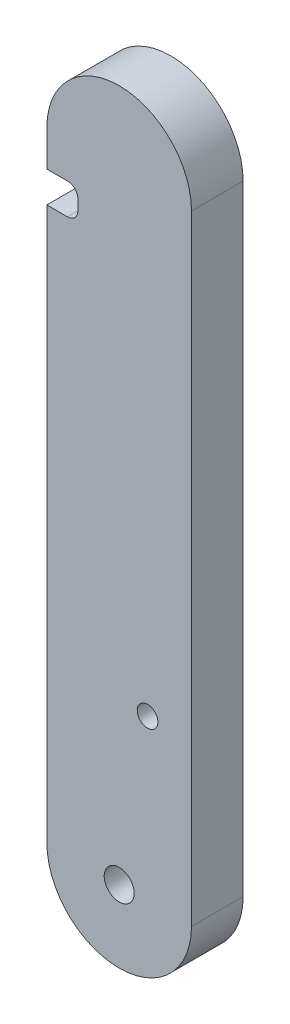
ISO-10303-21;
HEADER;
FILE_DESCRIPTION(('STEP AP214'),'2;1');
FILE_NAME('part.step','',(''),(''),'','','');
FILE_SCHEMA(('AUTOMOTIVE_DESIGN { 1 0 10303 214 1 1 1 1 }'));
ENDSEC;
DATA;
#1=APPLICATION_CONTEXT('core data for automotive mechanical design processes');
#2=APPLICATION_PROTOCOL_DEFINITION('international standard','automotive_design',2000,#1);
#3=PRODUCT_CONTEXT('',#1,'mechanical');
#4=PRODUCT('Part','Part','',(#3));
#5=PRODUCT_RELATED_PRODUCT_CATEGORY('part','',(#4));
#6=PRODUCT_DEFINITION_FORMATION('','',#4);
#7=PRODUCT_DEFINITION_CONTEXT('part definition',#1,'design');
#8=PRODUCT_DEFINITION('design','',#6,#7);
#9=PRODUCT_DEFINITION_SHAPE('','',#8);
#10=(LENGTH_UNIT() NAMED_UNIT(*) SI_UNIT(.MILLI.,.METRE.));
#11=(NAMED_UNIT(*) PLANE_ANGLE_UNIT() SI_UNIT($,.RADIAN.));
#12=(NAMED_UNIT(*) SI_UNIT($,.STERADIAN.) SOLID_ANGLE_UNIT());
#13=UNCERTAINTY_MEASURE_WITH_UNIT(LENGTH_MEASURE(1.E-05),#10,'distance_accuracy_value','');
#14=(GEOMETRIC_REPRESENTATION_CONTEXT(3) GLOBAL_UNCERTAINTY_ASSIGNED_CONTEXT((#13)) GLOBAL_UNIT_ASSIGNED_CONTEXT((#10,
#11,#12)) REPRESENTATION_CONTEXT('',''));
#15=CARTESIAN_POINT('',(0.,0.,0.));
#16=DIRECTION('',(0.,0.,1.));
#17=DIRECTION('',(1.,0.,0.));
#18=AXIS2_PLACEMENT_3D('',#15,#16,#17);
#19=CARTESIAN_POINT('',(-22.5000000000003,-15.5000000000001,5.));
#20=DIRECTION('',(-1.,0.,0.));
#21=DIRECTION('',(0.,0.,1.));
#22=AXIS2_PLACEMENT_3D('',#19,#20,#21);
#23=PLANE('',#22);
#24=DIRECTION('',(0.,0.,1.));
#25=VECTOR('',#24,1.);
#26=CARTESIAN_POINT('',(-22.5000000000003,40.999999999999,0.));
#27=LINE('',#26,#25);
#28=CARTESIAN_POINT('',(-22.5000000000003,40.999999999999,0.));
#29=VERTEX_POINT('',#28);
#30=CARTESIAN_POINT('',(-22.5000000000003,40.999999999999,5.));
#31=VERTEX_POINT('',#30);
#32=EDGE_CURVE('E128',#29,#31,#27,.T.);
#33=ORIENTED_EDGE('',*,*,#32,.T.);
#34=DIRECTION('',(0.,1.,0.));
#35=VECTOR('',#34,1.);
#36=CARTESIAN_POINT('',(-22.5000000000003,-15.5000000000001,5.));
#37=LINE('',#36,#35);
#38=CARTESIAN_POINT('',(-22.5000000000003,44.4999999999999,5.));
#39=VERTEX_POINT('',#38);
#40=EDGE_CURVE('E203',#31,#39,#37,.T.);
#41=ORIENTED_EDGE('',*,*,#40,.T.);
#42=DIRECTION('',(0.,0.,-1.));
#43=VECTOR('',#42,1.);
#44=CARTESIAN_POINT('',(-22.5000000000003,44.4999999999999,5.));
#45=LINE('',#44,#43);
#46=CARTESIAN_POINT('',(-22.5000000000003,44.4999999999999,0.));
#47=VERTEX_POINT('',#46);
#48=EDGE_CURVE('E147',#39,#47,#45,.T.);
#49=ORIENTED_EDGE('',*,*,#48,.T.);
#50=DIRECTION('',(0.,1.,0.));
#51=VECTOR('',#50,1.);
#52=CARTESIAN_POINT('',(-22.5000000000003,-15.5000000000001,0.));
#53=LINE('',#52,#51);
#54=EDGE_CURVE('E136',#29,#47,#53,.T.);
#55=ORIENTED_EDGE('',*,*,#54,.F.);
#56=EDGE_LOOP('',(#33,#41,#49,#55));
#57=FACE_BOUND('',#56,.T.);
#58=ADVANCED_FACE('F33',(#57),#23,.T.);
#59=CARTESIAN_POINT('',(-15.5000000000003,-15.5000000000001,5.));
#60=DIRECTION('',(0.,0.,-1.));
#61=DIRECTION('',(-1.,0.,0.));
#62=AXIS2_PLACEMENT_3D('',#59,#60,#61);
#63=CYLINDRICAL_SURFACE('',#62,7.);
#64=CARTESIAN_POINT('',(-15.5000000000003,-15.5000000000001,0.));
#65=DIRECTION('',(0.,0.,1.));
#66=DIRECTION('',(1.,0.,0.));
#67=AXIS2_PLACEMENT_3D('',#64,#65,#66);
#68=CIRCLE('',#67,7.);
#69=CARTESIAN_POINT('',(-22.5000000000003,-15.5000000000001,0.));
#70=VERTEX_POINT('',#69);
#71=CARTESIAN_POINT('',(-8.50000000000032,-15.5000000000001,0.));
#72=VERTEX_POINT('',#71);
#73=EDGE_CURVE('E134',#70,#72,#68,.T.);
#74=ORIENTED_EDGE('',*,*,#73,.T.);
#75=DIRECTION('',(0.,0.,-1.));
#76=VECTOR('',#75,1.);
#77=CARTESIAN_POINT('',(-8.50000000000032,-15.5000000000001,5.));
#78=LINE('',#77,#76);
#79=CARTESIAN_POINT('',(-8.50000000000032,-15.5000000000001,5.));
#80=VERTEX_POINT('',#79);
#81=EDGE_CURVE('E153',#80,#72,#78,.T.);
#82=ORIENTED_EDGE('',*,*,#81,.F.);
#83=CARTESIAN_POINT('',(-15.5000000000003,-15.5000000000001,5.));
#84=DIRECTION('',(0.,0.,1.));
#85=DIRECTION('',(1.,0.,0.));
#86=AXIS2_PLACEMENT_3D('',#83,#84,#85);
#87=CIRCLE('',#86,7.);
#88=CARTESIAN_POINT('',(-22.5000000000003,-15.5000000000001,5.));
#89=VERTEX_POINT('',#88);
#90=EDGE_CURVE('E135',#89,#80,#87,.T.);
#91=ORIENTED_EDGE('',*,*,#90,.F.);
#92=DIRECTION('',(0.,0.,-1.));
#93=VECTOR('',#92,1.);
#94=CARTESIAN_POINT('',(-22.5000000000003,-15.5000000000001,5.));
#95=LINE('',#94,#93);
#96=EDGE_CURVE('E145',#89,#70,#95,.T.);
#97=ORIENTED_EDGE('',*,*,#96,.T.);
#98=EDGE_LOOP('',(#74,#82,#91,#97));
#99=FACE_BOUND('',#98,.T.);
#100=ADVANCED_FACE('F219',(#99),#63,.T.);
#101=CARTESIAN_POINT('',(-8.50000000000032,-15.5000000000001,5.));
#102=DIRECTION('',(-1.,0.,0.));
#103=DIRECTION('',(0.,0.,1.));
#104=AXIS2_PLACEMENT_3D('',#101,#102,#103);
#105=PLANE('',#104);
#106=DIRECTION('',(0.,1.,0.));
#107=VECTOR('',#106,1.);
#108=CARTESIAN_POINT('',(-8.50000000000032,-15.5000000000001,0.));
#109=LINE('',#108,#107);
#110=CARTESIAN_POINT('',(-8.50000000000032,44.4999999999999,0.));
#111=VERTEX_POINT('',#110);
#112=EDGE_CURVE('E205',#72,#111,#109,.T.);
#113=ORIENTED_EDGE('',*,*,#112,.T.);
#114=DIRECTION('',(0.,0.,-1.));
#115=VECTOR('',#114,1.);
#116=CARTESIAN_POINT('',(-8.50000000000032,44.4999999999999,5.));
#117=LINE('',#116,#115);
#118=CARTESIAN_POINT('',(-8.50000000000032,44.4999999999999,5.));
#119=VERTEX_POINT('',#118);
#120=EDGE_CURVE('E150',#119,#111,#117,.T.);
#121=ORIENTED_EDGE('',*,*,#120,.F.);
#122=DIRECTION('',(0.,1.,0.));
#123=VECTOR('',#122,1.);
#124=CARTESIAN_POINT('',(-8.50000000000032,-15.5000000000001,5.));
#125=LINE('',#124,#123);
#126=EDGE_CURVE('E139',#80,#119,#125,.T.);
#127=ORIENTED_EDGE('',*,*,#126,.F.);
#128=ORIENTED_EDGE('',*,*,#81,.T.);
#129=EDGE_LOOP('',(#113,#121,#127,#128));
#130=FACE_BOUND('',#129,.T.);
#131=ADVANCED_FACE('F217',(#130),#105,.F.);
#132=CARTESIAN_POINT('',(-15.5000000000003,44.4999999999999,5.));
#133=DIRECTION('',(0.,0.,-1.));
#134=DIRECTION('',(-1.,0.,0.));
#135=AXIS2_PLACEMENT_3D('',#132,#133,#134);
#136=CYLINDRICAL_SURFACE('',#135,7.);
#137=CARTESIAN_POINT('',(-15.5000000000003,44.4999999999999,0.));
#138=DIRECTION('',(0.,0.,1.));
#139=DIRECTION('',(1.,0.,0.));
#140=AXIS2_PLACEMENT_3D('',#137,#138,#139);
#141=CIRCLE('',#140,7.);
#142=EDGE_CURVE('E141',#111,#47,#141,.T.);
#143=ORIENTED_EDGE('',*,*,#142,.T.);
#144=ORIENTED_EDGE('',*,*,#48,.F.);
#145=CARTESIAN_POINT('',(-15.5000000000003,44.4999999999999,5.));
#146=DIRECTION('',(0.,0.,1.));
#147=DIRECTION('',(1.,0.,0.));
#148=AXIS2_PLACEMENT_3D('',#145,#146,#147);
#149=CIRCLE('',#148,7.);
#150=EDGE_CURVE('E200',#119,#39,#149,.T.);
#151=ORIENTED_EDGE('',*,*,#150,.F.);
#152=ORIENTED_EDGE('',*,*,#120,.T.);
#153=EDGE_LOOP('',(#143,#144,#151,#152));
#154=FACE_BOUND('',#153,.T.);
#155=ADVANCED_FACE('F212',(#154),#136,.T.);
#156=DIRECTION('',(0.,0.,1.));
#157=VECTOR('',#156,1.);
#158=CARTESIAN_POINT('',(-22.5000000000003,37.999999999999,0.));
#159=LINE('',#158,#157);
#160=CARTESIAN_POINT('',(-22.5000000000003,37.999999999999,0.));
#161=VERTEX_POINT('',#160);
#162=CARTESIAN_POINT('',(-22.5000000000003,37.999999999999,5.));
#163=VERTEX_POINT('',#162);
#164=EDGE_CURVE('E112',#161,#163,#159,.T.);
#165=ORIENTED_EDGE('',*,*,#164,.F.);
#166=EDGE_CURVE('E125',#70,#161,#53,.T.);
#167=ORIENTED_EDGE('',*,*,#166,.F.);
#168=ORIENTED_EDGE('',*,*,#96,.F.);
#169=EDGE_CURVE('E127',#89,#163,#37,.T.);
#170=ORIENTED_EDGE('',*,*,#169,.T.);
#171=EDGE_LOOP('',(#165,#167,#168,#170));
#172=FACE_BOUND('',#171,.T.);
#173=ADVANCED_FACE('F124',(#172),#23,.T.);
#174=CARTESIAN_POINT('',(-15.5000000000003,-15.5000000000001,5.));
#175=DIRECTION('',(0.,0.,1.));
#176=DIRECTION('',(1.,0.,0.));
#177=AXIS2_PLACEMENT_3D('',#174,#175,#176);
#178=PLANE('',#177);
#179=CARTESIAN_POINT('',(-15.5000000000001,-15.500000000001,5.));
#180=DIRECTION('',(0.,0.,1.));
#181=DIRECTION('',(1.,0.,0.));
#182=AXIS2_PLACEMENT_3D('',#179,#180,#181);
#183=CIRCLE('',#182,1.45);
#184=CARTESIAN_POINT('',(-14.0500000000001,-15.500000000001,5.));
#185=VERTEX_POINT('',#184);
#186=EDGE_CURVE('E266',#185,#185,#183,.T.);
#187=ORIENTED_EDGE('',*,*,#186,.F.);
#188=EDGE_LOOP('',(#187));
#189=FACE_BOUND('',#188,.T.);
#190=DIRECTION('',(-1.,0.,0.));
#191=VECTOR('',#190,1.);
#192=CARTESIAN_POINT('',(-19.5000000000003,40.999999999999,5.));
#193=LINE('',#192,#191);
#194=CARTESIAN_POINT('',(-20.5000000000003,40.999999999999,5.));
#195=VERTEX_POINT('',#194);
#196=EDGE_CURVE('E119',#195,#31,#193,.T.);
#197=ORIENTED_EDGE('',*,*,#196,.F.);
#198=CARTESIAN_POINT('',(-20.5000000000003,39.999999999999,5.));
#199=DIRECTION('',(0.,0.,1.));
#200=DIRECTION('',(1.,0.,0.));
#201=AXIS2_PLACEMENT_3D('',#198,#199,#200);
#202=CIRCLE('',#201,1.);
#203=CARTESIAN_POINT('',(-19.5000000000003,39.999999999999,5.));
#204=VERTEX_POINT('',#203);
#205=EDGE_CURVE('E41',#195,#204,#202,.F.);
#206=ORIENTED_EDGE('',*,*,#205,.T.);
#207=DIRECTION('',(0.,1.,0.));
#208=VECTOR('',#207,1.);
#209=CARTESIAN_POINT('',(-19.5000000000003,40.999999999999,5.));
#210=LINE('',#209,#208);
#211=CARTESIAN_POINT('',(-19.5000000000003,38.999999999999,5.));
#212=VERTEX_POINT('',#211);
#213=EDGE_CURVE('E173',#212,#204,#210,.T.);
#214=ORIENTED_EDGE('',*,*,#213,.F.);
#215=CARTESIAN_POINT('',(-20.5000000000003,38.999999999999,5.));
#216=DIRECTION('',(0.,0.,1.));
#217=DIRECTION('',(1.,0.,0.));
#218=AXIS2_PLACEMENT_3D('',#215,#216,#217);
#219=CIRCLE('',#218,1.);
#220=CARTESIAN_POINT('',(-20.5000000000003,37.999999999999,5.));
#221=VERTEX_POINT('',#220);
#222=EDGE_CURVE('E164',#212,#221,#219,.F.);
#223=ORIENTED_EDGE('',*,*,#222,.T.);
#224=DIRECTION('',(1.,0.,0.));
#225=VECTOR('',#224,1.);
#226=CARTESIAN_POINT('',(-19.5000000000003,37.999999999999,5.));
#227=LINE('',#226,#225);
#228=EDGE_CURVE('E179',#163,#221,#227,.T.);
#229=ORIENTED_EDGE('',*,*,#228,.F.);
#230=ORIENTED_EDGE('',*,*,#169,.F.);
#231=ORIENTED_EDGE('',*,*,#90,.T.);
#232=ORIENTED_EDGE('',*,*,#126,.T.);
#233=ORIENTED_EDGE('',*,*,#150,.T.);
#234=ORIENTED_EDGE('',*,*,#40,.F.);
#235=EDGE_LOOP('',(#197,#206,#214,#223,#229,#230,#231,#232,#233,#234));
#236=FACE_BOUND('',#235,.T.);
#237=CARTESIAN_POINT('',(-12.7499999999999,0.,5.));
#238=DIRECTION('',(0.,0.,1.));
#239=DIRECTION('',(1.,0.,0.));
#240=AXIS2_PLACEMENT_3D('',#237,#238,#239);
#241=CIRCLE('',#240,1.);
#242=CARTESIAN_POINT('',(-11.7499999999999,0.,5.));
#243=VERTEX_POINT('',#242);
#244=EDGE_CURVE('E192',#243,#243,#241,.T.);
#245=ORIENTED_EDGE('',*,*,#244,.F.);
#246=EDGE_LOOP('',(#245));
#247=FACE_BOUND('',#246,.T.);
#248=ADVANCED_FACE('F171',(#189,#236,#247),#178,.T.);
#249=CARTESIAN_POINT('',(-15.5000000000003,-15.5000000000001,0.));
#250=DIRECTION('',(0.,0.,1.));
#251=DIRECTION('',(1.,0.,0.));
#252=AXIS2_PLACEMENT_3D('',#249,#250,#251);
#253=PLANE('',#252);
#254=CARTESIAN_POINT('',(-15.5000000000001,-15.500000000001,0.));
#255=DIRECTION('',(0.,0.,1.));
#256=DIRECTION('',(1.,0.,0.));
#257=AXIS2_PLACEMENT_3D('',#254,#255,#256);
#258=CIRCLE('',#257,1.45);
#259=CARTESIAN_POINT('',(-14.0500000000001,-15.500000000001,0.));
#260=VERTEX_POINT('',#259);
#261=EDGE_CURVE('E189',#260,#260,#258,.T.);
#262=ORIENTED_EDGE('',*,*,#261,.T.);
#263=EDGE_LOOP('',(#262));
#264=FACE_BOUND('',#263,.T.);
#265=CARTESIAN_POINT('',(-12.7499999999999,0.,0.));
#266=DIRECTION('',(0.,0.,1.));
#267=DIRECTION('',(1.,0.,0.));
#268=AXIS2_PLACEMENT_3D('',#265,#266,#267);
#269=CIRCLE('',#268,1.);
#270=CARTESIAN_POINT('',(-11.7499999999999,0.,0.));
#271=VERTEX_POINT('',#270);
#272=EDGE_CURVE('E194',#271,#271,#269,.T.);
#273=ORIENTED_EDGE('',*,*,#272,.T.);
#274=EDGE_LOOP('',(#273));
#275=FACE_BOUND('',#274,.T.);
#276=DIRECTION('',(1.,0.,0.));
#277=VECTOR('',#276,1.);
#278=CARTESIAN_POINT('',(-19.5000000000003,37.999999999999,0.));
#279=LINE('',#278,#277);
#280=CARTESIAN_POINT('',(-20.5000000000003,37.999999999999,0.));
#281=VERTEX_POINT('',#280);
#282=EDGE_CURVE('E108',#161,#281,#279,.T.);
#283=ORIENTED_EDGE('',*,*,#282,.T.);
#284=CARTESIAN_POINT('',(-20.5000000000003,38.999999999999,0.));
#285=DIRECTION('',(0.,0.,1.));
#286=DIRECTION('',(1.,0.,0.));
#287=AXIS2_PLACEMENT_3D('',#284,#285,#286);
#288=CIRCLE('',#287,1.);
#289=CARTESIAN_POINT('',(-19.5000000000003,38.999999999999,0.));
#290=VERTEX_POINT('',#289);
#291=EDGE_CURVE('E166',#281,#290,#288,.T.);
#292=ORIENTED_EDGE('',*,*,#291,.T.);
#293=DIRECTION('',(0.,1.,0.));
#294=VECTOR('',#293,1.);
#295=CARTESIAN_POINT('',(-19.5000000000003,40.999999999999,0.));
#296=LINE('',#295,#294);
#297=CARTESIAN_POINT('',(-19.5000000000003,39.999999999999,0.));
#298=VERTEX_POINT('',#297);
#299=EDGE_CURVE('E118',#290,#298,#296,.T.);
#300=ORIENTED_EDGE('',*,*,#299,.T.);
#301=CARTESIAN_POINT('',(-20.5000000000003,39.999999999999,0.));
#302=DIRECTION('',(0.,0.,1.));
#303=DIRECTION('',(1.,0.,0.));
#304=AXIS2_PLACEMENT_3D('',#301,#302,#303);
#305=CIRCLE('',#304,1.);
#306=CARTESIAN_POINT('',(-20.5000000000003,40.999999999999,0.));
#307=VERTEX_POINT('',#306);
#308=EDGE_CURVE('E11',#298,#307,#305,.T.);
#309=ORIENTED_EDGE('',*,*,#308,.T.);
#310=DIRECTION('',(-1.,0.,0.));
#311=VECTOR('',#310,1.);
#312=CARTESIAN_POINT('',(-19.5000000000003,40.999999999999,0.));
#313=LINE('',#312,#311);
#314=EDGE_CURVE('E129',#307,#29,#313,.T.);
#315=ORIENTED_EDGE('',*,*,#314,.T.);
#316=ORIENTED_EDGE('',*,*,#54,.T.);
#317=ORIENTED_EDGE('',*,*,#142,.F.);
#318=ORIENTED_EDGE('',*,*,#112,.F.);
#319=ORIENTED_EDGE('',*,*,#73,.F.);
#320=ORIENTED_EDGE('',*,*,#166,.T.);
#321=EDGE_LOOP('',(#283,#292,#300,#309,#315,#316,#317,#318,#319,#320));
#322=FACE_BOUND('',#321,.T.);
#323=ADVANCED_FACE('F132',(#264,#275,#322),#253,.F.);
#324=CARTESIAN_POINT('',(-12.7499999999999,0.,0.));
#325=DIRECTION('',(0.,0.,1.));
#326=DIRECTION('',(1.,0.,0.));
#327=AXIS2_PLACEMENT_3D('',#324,#325,#326);
#328=CYLINDRICAL_SURFACE('',#327,1.);
#329=ORIENTED_EDGE('',*,*,#272,.F.);
#330=EDGE_LOOP('',(#329));
#331=FACE_BOUND('',#330,.T.);
#332=ORIENTED_EDGE('',*,*,#244,.T.);
#333=EDGE_LOOP('',(#332));
#334=FACE_BOUND('',#333,.T.);
#335=ADVANCED_FACE('F242',(#331,#334),#328,.F.);
#336=CARTESIAN_POINT('',(-19.5000000000003,40.999999999999,0.));
#337=DIRECTION('',(0.,1.,0.));
#338=DIRECTION('',(0.,0.,1.));
#339=AXIS2_PLACEMENT_3D('',#336,#337,#338);
#340=PLANE('',#339);
#341=ORIENTED_EDGE('',*,*,#314,.F.);
#342=DIRECTION('',(0.,0.,1.));
#343=VECTOR('',#342,1.);
#344=CARTESIAN_POINT('',(-20.5000000000003,40.999999999999,5.));
#345=LINE('',#344,#343);
#346=EDGE_CURVE('E162',#307,#195,#345,.T.);
#347=ORIENTED_EDGE('',*,*,#346,.T.);
#348=ORIENTED_EDGE('',*,*,#196,.T.);
#349=ORIENTED_EDGE('',*,*,#32,.F.);
#350=EDGE_LOOP('',(#341,#347,#348,#349));
#351=FACE_BOUND('',#350,.T.);
#352=ADVANCED_FACE('F182',(#351),#340,.F.);
#353=CARTESIAN_POINT('',(-19.5000000000003,40.999999999999,0.));
#354=DIRECTION('',(1.,0.,0.));
#355=DIRECTION('',(0.,0.,-1.));
#356=AXIS2_PLACEMENT_3D('',#353,#354,#355);
#357=PLANE('',#356);
#358=ORIENTED_EDGE('',*,*,#299,.F.);
#359=DIRECTION('',(0.,0.,1.));
#360=VECTOR('',#359,1.);
#361=CARTESIAN_POINT('',(-19.5000000000003,38.999999999999,5.));
#362=LINE('',#361,#360);
#363=EDGE_CURVE('E158',#290,#212,#362,.T.);
#364=ORIENTED_EDGE('',*,*,#363,.T.);
#365=ORIENTED_EDGE('',*,*,#213,.T.);
#366=DIRECTION('',(0.,0.,1.));
#367=VECTOR('',#366,1.);
#368=CARTESIAN_POINT('',(-19.5000000000003,39.999999999999,0.));
#369=LINE('',#368,#367);
#370=EDGE_CURVE('E156',#204,#298,#369,.F.);
#371=ORIENTED_EDGE('',*,*,#370,.T.);
#372=EDGE_LOOP('',(#358,#364,#365,#371));
#373=FACE_BOUND('',#372,.T.);
#374=ADVANCED_FACE('F177',(#373),#357,.F.);
#375=CARTESIAN_POINT('',(-19.5000000000003,37.999999999999,0.));
#376=DIRECTION('',(0.,-1.,0.));
#377=DIRECTION('',(0.,0.,-1.));
#378=AXIS2_PLACEMENT_3D('',#375,#376,#377);
#379=PLANE('',#378);
#380=ORIENTED_EDGE('',*,*,#228,.T.);
#381=DIRECTION('',(0.,0.,1.));
#382=VECTOR('',#381,1.);
#383=CARTESIAN_POINT('',(-20.5000000000003,37.999999999999,0.));
#384=LINE('',#383,#382);
#385=EDGE_CURVE('E115',#221,#281,#384,.F.);
#386=ORIENTED_EDGE('',*,*,#385,.T.);
#387=ORIENTED_EDGE('',*,*,#282,.F.);
#388=ORIENTED_EDGE('',*,*,#164,.T.);
#389=EDGE_LOOP('',(#380,#386,#387,#388));
#390=FACE_BOUND('',#389,.T.);
#391=ADVANCED_FACE('F111',(#390),#379,.F.);
#392=CARTESIAN_POINT('',(-20.5000000000003,38.999999999999,0.));
#393=DIRECTION('',(0.,0.,-1.));
#394=DIRECTION('',(-1.,0.,0.));
#395=AXIS2_PLACEMENT_3D('',#392,#393,#394);
#396=CYLINDRICAL_SURFACE('',#395,1.);
#397=ORIENTED_EDGE('',*,*,#291,.F.);
#398=ORIENTED_EDGE('',*,*,#385,.F.);
#399=ORIENTED_EDGE('',*,*,#222,.F.);
#400=ORIENTED_EDGE('',*,*,#363,.F.);
#401=EDGE_LOOP('',(#397,#398,#399,#400));
#402=FACE_BOUND('',#401,.T.);
#403=ADVANCED_FACE('F251',(#402),#396,.F.);
#404=CARTESIAN_POINT('',(-20.5000000000003,39.999999999999,0.));
#405=DIRECTION('',(0.,0.,-1.));
#406=DIRECTION('',(-1.,0.,0.));
#407=AXIS2_PLACEMENT_3D('',#404,#405,#406);
#408=CYLINDRICAL_SURFACE('',#407,1.);
#409=ORIENTED_EDGE('',*,*,#308,.F.);
#410=ORIENTED_EDGE('',*,*,#370,.F.);
#411=ORIENTED_EDGE('',*,*,#205,.F.);
#412=ORIENTED_EDGE('',*,*,#346,.F.);
#413=EDGE_LOOP('',(#409,#410,#411,#412));
#414=FACE_BOUND('',#413,.T.);
#415=ADVANCED_FACE('F35',(#414),#408,.F.);
#416=CARTESIAN_POINT('',(-15.5000000000001,-15.500000000001,0.));
#417=DIRECTION('',(0.,0.,1.));
#418=DIRECTION('',(1.,0.,0.));
#419=AXIS2_PLACEMENT_3D('',#416,#417,#418);
#420=CYLINDRICAL_SURFACE('',#419,1.45);
#421=ORIENTED_EDGE('',*,*,#261,.F.);
#422=EDGE_LOOP('',(#421));
#423=FACE_BOUND('',#422,.T.);
#424=ORIENTED_EDGE('',*,*,#186,.T.);
#425=EDGE_LOOP('',(#424));
#426=FACE_BOUND('',#425,.T.);
#427=ADVANCED_FACE('F256',(#423,#426),#420,.F.);
#428=CLOSED_SHELL('',(#58,#100,#131,#155,#173,#248,#323,#335,#352,#374,#391,#403,#415,#427));
#429=MANIFOLD_SOLID_BREP('B2',#428);
#430=ADVANCED_BREP_SHAPE_REPRESENTATION('',(#18,#429),#14);
#431=SHAPE_DEFINITION_REPRESENTATION(#9,#430);
ENDSEC;
END-ISO-10303-21;
